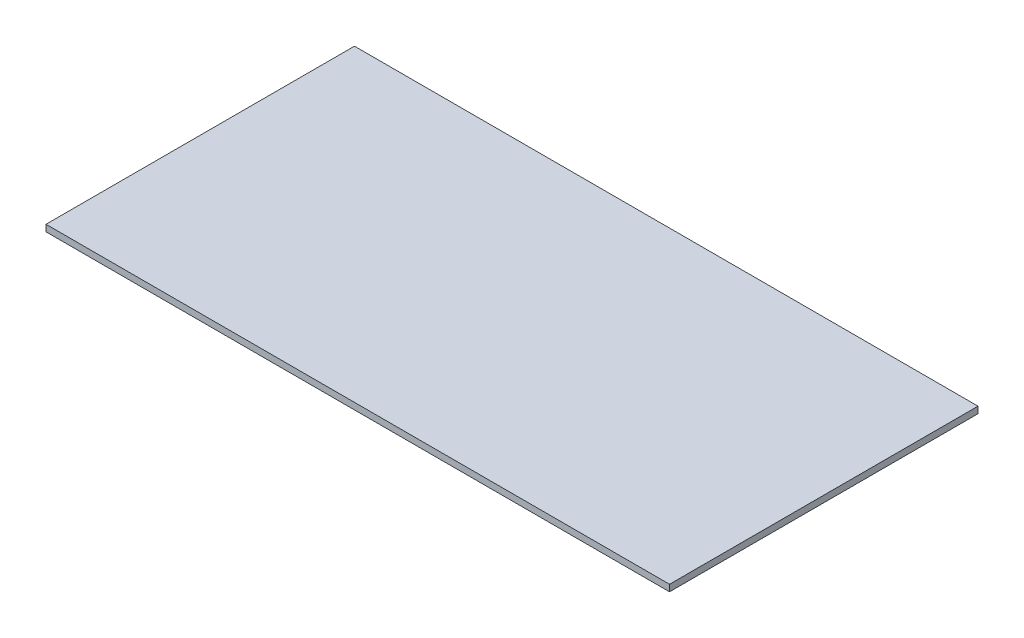
ISO-10303-21;
HEADER;
FILE_DESCRIPTION(('STEP AP214'),'2;1');
FILE_NAME('part.step','',(''),(''),'','','');
FILE_SCHEMA(('AUTOMOTIVE_DESIGN { 1 0 10303 214 1 1 1 1 }'));
ENDSEC;
DATA;
#1=APPLICATION_CONTEXT('core data for automotive mechanical design processes');
#2=APPLICATION_PROTOCOL_DEFINITION('international standard','automotive_design',2000,#1);
#3=PRODUCT_CONTEXT('',#1,'mechanical');
#4=PRODUCT('Part','Part','',(#3));
#5=PRODUCT_RELATED_PRODUCT_CATEGORY('part','',(#4));
#6=PRODUCT_DEFINITION_FORMATION('','',#4);
#7=PRODUCT_DEFINITION_CONTEXT('part definition',#1,'design');
#8=PRODUCT_DEFINITION('design','',#6,#7);
#9=PRODUCT_DEFINITION_SHAPE('','',#8);
#10=(LENGTH_UNIT() NAMED_UNIT(*) SI_UNIT(.MILLI.,.METRE.));
#11=(NAMED_UNIT(*) PLANE_ANGLE_UNIT() SI_UNIT($,.RADIAN.));
#12=(NAMED_UNIT(*) SI_UNIT($,.STERADIAN.) SOLID_ANGLE_UNIT());
#13=UNCERTAINTY_MEASURE_WITH_UNIT(LENGTH_MEASURE(1.E-05),#10,'distance_accuracy_value','');
#14=(GEOMETRIC_REPRESENTATION_CONTEXT(3) GLOBAL_UNCERTAINTY_ASSIGNED_CONTEXT((#13)) GLOBAL_UNIT_ASSIGNED_CONTEXT((#10,
#11,#12)) REPRESENTATION_CONTEXT('',''));
#15=CARTESIAN_POINT('',(0.,0.,0.));
#16=DIRECTION('',(0.,0.,1.));
#17=DIRECTION('',(1.,0.,0.));
#18=AXIS2_PLACEMENT_3D('',#15,#16,#17);
#19=CARTESIAN_POINT('',(-142.5,3.,70.5));
#20=DIRECTION('',(1.,0.,0.));
#21=DIRECTION('',(0.,0.,-1.));
#22=AXIS2_PLACEMENT_3D('',#19,#20,#21);
#23=PLANE('',#22);
#24=DIRECTION('',(0.,0.,1.));
#25=VECTOR('',#24,1.);
#26=CARTESIAN_POINT('',(-142.5,0.,70.5));
#27=LINE('',#26,#25);
#28=CARTESIAN_POINT('',(-142.5,0.,-70.5));
#29=VERTEX_POINT('',#28);
#30=CARTESIAN_POINT('',(-142.5,0.,70.5));
#31=VERTEX_POINT('',#30);
#32=EDGE_CURVE('E96',#29,#31,#27,.T.);
#33=ORIENTED_EDGE('',*,*,#32,.T.);
#34=DIRECTION('',(0.,-1.,0.));
#35=VECTOR('',#34,1.);
#36=CARTESIAN_POINT('',(-142.5,3.,70.5));
#37=LINE('',#36,#35);
#38=CARTESIAN_POINT('',(-142.5,3.,70.5));
#39=VERTEX_POINT('',#38);
#40=EDGE_CURVE('E11',#39,#31,#37,.T.);
#41=ORIENTED_EDGE('',*,*,#40,.F.);
#42=DIRECTION('',(0.,0.,1.));
#43=VECTOR('',#42,1.);
#44=CARTESIAN_POINT('',(-142.5,3.,70.5));
#45=LINE('',#44,#43);
#46=CARTESIAN_POINT('',(-142.5,3.,-70.5));
#47=VERTEX_POINT('',#46);
#48=EDGE_CURVE('E84',#47,#39,#45,.T.);
#49=ORIENTED_EDGE('',*,*,#48,.F.);
#50=DIRECTION('',(0.,-1.,0.));
#51=VECTOR('',#50,1.);
#52=CARTESIAN_POINT('',(-142.5,3.,-70.5));
#53=LINE('',#52,#51);
#54=EDGE_CURVE('E92',#47,#29,#53,.T.);
#55=ORIENTED_EDGE('',*,*,#54,.T.);
#56=EDGE_LOOP('',(#33,#41,#49,#55));
#57=FACE_BOUND('',#56,.T.);
#58=ADVANCED_FACE('F33',(#57),#23,.F.);
#59=CARTESIAN_POINT('',(142.5,3.,70.5));
#60=DIRECTION('',(0.,0.,-1.));
#61=DIRECTION('',(-1.,0.,0.));
#62=AXIS2_PLACEMENT_3D('',#59,#60,#61);
#63=PLANE('',#62);
#64=DIRECTION('',(1.,0.,0.));
#65=VECTOR('',#64,1.);
#66=CARTESIAN_POINT('',(142.5,0.,70.5));
#67=LINE('',#66,#65);
#68=CARTESIAN_POINT('',(142.5,0.,70.5));
#69=VERTEX_POINT('',#68);
#70=EDGE_CURVE('E88',#31,#69,#67,.T.);
#71=ORIENTED_EDGE('',*,*,#70,.T.);
#72=DIRECTION('',(0.,-1.,0.));
#73=VECTOR('',#72,1.);
#74=CARTESIAN_POINT('',(142.5,3.,70.5));
#75=LINE('',#74,#73);
#76=CARTESIAN_POINT('',(142.5,3.,70.5));
#77=VERTEX_POINT('',#76);
#78=EDGE_CURVE('E41',#77,#69,#75,.T.);
#79=ORIENTED_EDGE('',*,*,#78,.F.);
#80=DIRECTION('',(1.,0.,0.));
#81=VECTOR('',#80,1.);
#82=CARTESIAN_POINT('',(142.5,3.,70.5));
#83=LINE('',#82,#81);
#84=EDGE_CURVE('E79',#39,#77,#83,.T.);
#85=ORIENTED_EDGE('',*,*,#84,.F.);
#86=ORIENTED_EDGE('',*,*,#40,.T.);
#87=EDGE_LOOP('',(#71,#79,#85,#86));
#88=FACE_BOUND('',#87,.T.);
#89=ADVANCED_FACE('F87',(#88),#63,.F.);
#90=CARTESIAN_POINT('',(142.5,3.,70.5));
#91=DIRECTION('',(-1.,0.,0.));
#92=DIRECTION('',(0.,0.,1.));
#93=AXIS2_PLACEMENT_3D('',#90,#91,#92);
#94=PLANE('',#93);
#95=DIRECTION('',(0.,0.,-1.));
#96=VECTOR('',#95,1.);
#97=CARTESIAN_POINT('',(142.5,0.,70.5));
#98=LINE('',#97,#96);
#99=CARTESIAN_POINT('',(142.5,0.,-70.5));
#100=VERTEX_POINT('',#99);
#101=EDGE_CURVE('E66',#69,#100,#98,.T.);
#102=ORIENTED_EDGE('',*,*,#101,.T.);
#103=DIRECTION('',(0.,-1.,0.));
#104=VECTOR('',#103,1.);
#105=CARTESIAN_POINT('',(142.5,3.,-70.5));
#106=LINE('',#105,#104);
#107=CARTESIAN_POINT('',(142.5,3.,-70.5));
#108=VERTEX_POINT('',#107);
#109=EDGE_CURVE('E89',#108,#100,#106,.T.);
#110=ORIENTED_EDGE('',*,*,#109,.F.);
#111=DIRECTION('',(0.,0.,-1.));
#112=VECTOR('',#111,1.);
#113=CARTESIAN_POINT('',(142.5,3.,70.5));
#114=LINE('',#113,#112);
#115=EDGE_CURVE('E82',#77,#108,#114,.T.);
#116=ORIENTED_EDGE('',*,*,#115,.F.);
#117=ORIENTED_EDGE('',*,*,#78,.T.);
#118=EDGE_LOOP('',(#102,#110,#116,#117));
#119=FACE_BOUND('',#118,.T.);
#120=ADVANCED_FACE('F90',(#119),#94,.F.);
#121=CARTESIAN_POINT('',(142.5,3.,-70.5));
#122=DIRECTION('',(0.,0.,1.));
#123=DIRECTION('',(1.,0.,0.));
#124=AXIS2_PLACEMENT_3D('',#121,#122,#123);
#125=PLANE('',#124);
#126=DIRECTION('',(-1.,0.,0.));
#127=VECTOR('',#126,1.);
#128=CARTESIAN_POINT('',(142.5,0.,-70.5));
#129=LINE('',#128,#127);
#130=EDGE_CURVE('E72',#100,#29,#129,.T.);
#131=ORIENTED_EDGE('',*,*,#130,.T.);
#132=ORIENTED_EDGE('',*,*,#54,.F.);
#133=DIRECTION('',(-1.,0.,0.));
#134=VECTOR('',#133,1.);
#135=CARTESIAN_POINT('',(142.5,3.,-70.5));
#136=LINE('',#135,#134);
#137=EDGE_CURVE('E49',#108,#47,#136,.T.);
#138=ORIENTED_EDGE('',*,*,#137,.F.);
#139=ORIENTED_EDGE('',*,*,#109,.T.);
#140=EDGE_LOOP('',(#131,#132,#138,#139));
#141=FACE_BOUND('',#140,.T.);
#142=ADVANCED_FACE('F103',(#141),#125,.F.);
#143=CARTESIAN_POINT('',(-142.5,3.,-70.5));
#144=DIRECTION('',(0.,1.,0.));
#145=DIRECTION('',(0.,0.,1.));
#146=AXIS2_PLACEMENT_3D('',#143,#144,#145);
#147=PLANE('',#146);
#148=ORIENTED_EDGE('',*,*,#48,.T.);
#149=ORIENTED_EDGE('',*,*,#84,.T.);
#150=ORIENTED_EDGE('',*,*,#115,.T.);
#151=ORIENTED_EDGE('',*,*,#137,.T.);
#152=EDGE_LOOP('',(#148,#149,#150,#151));
#153=FACE_BOUND('',#152,.T.);
#154=ADVANCED_FACE('F80',(#153),#147,.T.);
#155=CARTESIAN_POINT('',(-142.5,0.,-70.5));
#156=DIRECTION('',(0.,1.,0.));
#157=DIRECTION('',(0.,0.,1.));
#158=AXIS2_PLACEMENT_3D('',#155,#156,#157);
#159=PLANE('',#158);
#160=ORIENTED_EDGE('',*,*,#32,.F.);
#161=ORIENTED_EDGE('',*,*,#130,.F.);
#162=ORIENTED_EDGE('',*,*,#101,.F.);
#163=ORIENTED_EDGE('',*,*,#70,.F.);
#164=EDGE_LOOP('',(#160,#161,#162,#163));
#165=FACE_BOUND('',#164,.T.);
#166=ADVANCED_FACE('F106',(#165),#159,.F.);
#167=CLOSED_SHELL('',(#58,#89,#120,#142,#154,#166));
#168=MANIFOLD_SOLID_BREP('B2',#167);
#169=ADVANCED_BREP_SHAPE_REPRESENTATION('',(#18,#168),#14);
#170=SHAPE_DEFINITION_REPRESENTATION(#9,#169);
ENDSEC;
END-ISO-10303-21;
